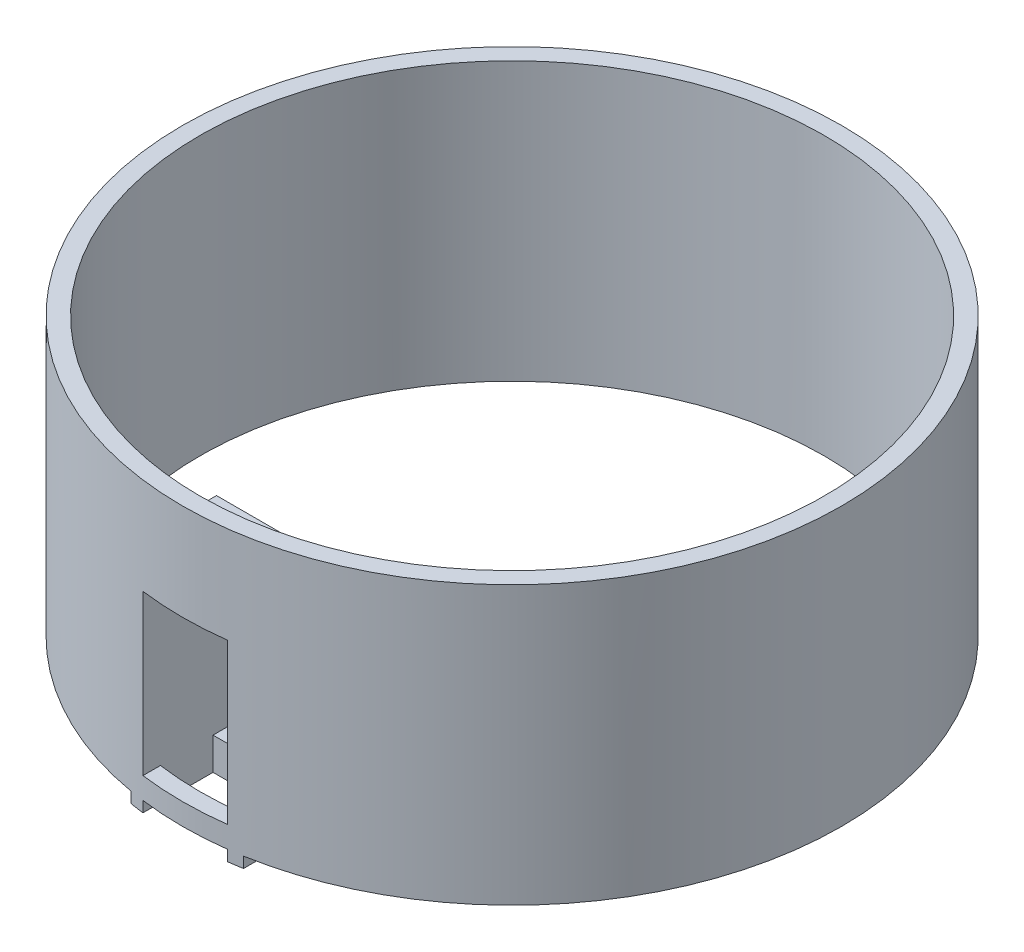
ISO-10303-21;
HEADER;
FILE_DESCRIPTION(('STEP AP214'),'2;1');
FILE_NAME('part.step','',(''),(''),'','','');
FILE_SCHEMA(('AUTOMOTIVE_DESIGN { 1 0 10303 214 1 1 1 1 }'));
ENDSEC;
DATA;
#1=APPLICATION_CONTEXT('core data for automotive mechanical design processes');
#2=APPLICATION_PROTOCOL_DEFINITION('international standard','automotive_design',2000,#1);
#3=PRODUCT_CONTEXT('',#1,'mechanical');
#4=PRODUCT('Part','Part','',(#3));
#5=PRODUCT_RELATED_PRODUCT_CATEGORY('part','',(#4));
#6=PRODUCT_DEFINITION_FORMATION('','',#4);
#7=PRODUCT_DEFINITION_CONTEXT('part definition',#1,'design');
#8=PRODUCT_DEFINITION('design','',#6,#7);
#9=PRODUCT_DEFINITION_SHAPE('','',#8);
#10=(LENGTH_UNIT() NAMED_UNIT(*) SI_UNIT(.MILLI.,.METRE.));
#11=(NAMED_UNIT(*) PLANE_ANGLE_UNIT() SI_UNIT($,.RADIAN.));
#12=(NAMED_UNIT(*) SI_UNIT($,.STERADIAN.) SOLID_ANGLE_UNIT());
#13=UNCERTAINTY_MEASURE_WITH_UNIT(LENGTH_MEASURE(1.E-05),#10,'distance_accuracy_value','');
#14=(GEOMETRIC_REPRESENTATION_CONTEXT(3) GLOBAL_UNCERTAINTY_ASSIGNED_CONTEXT((#13)) GLOBAL_UNIT_ASSIGNED_CONTEXT((#10,
#11,#12)) REPRESENTATION_CONTEXT('',''));
#15=CARTESIAN_POINT('',(0.,0.,0.));
#16=DIRECTION('',(0.,0.,1.));
#17=DIRECTION('',(1.,0.,0.));
#18=AXIS2_PLACEMENT_3D('',#15,#16,#17);
#19=CARTESIAN_POINT('',(0.,20.,0.));
#20=DIRECTION('',(0.,-1.,0.));
#21=DIRECTION('',(0.,0.,-1.));
#22=AXIS2_PLACEMENT_3D('',#19,#20,#21);
#23=CYLINDRICAL_SURFACE('',#22,45.);
#24=CARTESIAN_POINT('',(0.,20.,0.));
#25=DIRECTION('',(0.,1.,0.));
#26=DIRECTION('',(0.,0.,1.));
#27=AXIS2_PLACEMENT_3D('',#24,#25,#26);
#28=CIRCLE('',#27,45.);
#29=CARTESIAN_POINT('',(0.,20.,45.));
#30=VERTEX_POINT('',#29);
#31=EDGE_CURVE('E319',#30,#30,#28,.T.);
#32=ORIENTED_EDGE('',*,*,#31,.T.);
#33=EDGE_LOOP('',(#32));
#34=FACE_BOUND('',#33,.T.);
#35=DIRECTION('',(0.,-1.,0.));
#36=VECTOR('',#35,1.);
#37=CARTESIAN_POINT('',(6.10000000000001,20.,44.584638610176));
#38=LINE('',#37,#36);
#39=CARTESIAN_POINT('',(6.10000000000001,10.75,44.584638610176));
#40=VERTEX_POINT('',#39);
#41=CARTESIAN_POINT('',(6.10000000000001,6.1,44.584638610176));
#42=VERTEX_POINT('',#41);
#43=EDGE_CURVE('E281',#40,#42,#38,.T.);
#44=ORIENTED_EDGE('',*,*,#43,.T.);
#45=CARTESIAN_POINT('',(0.,6.1,0.));
#46=DIRECTION('',(0.,-1.,0.));
#47=DIRECTION('',(0.,0.,-1.));
#48=AXIS2_PLACEMENT_3D('',#45,#46,#47);
#49=CIRCLE('',#48,45.);
#50=CARTESIAN_POINT('',(-6.09999999999999,6.1,44.584638610176));
#51=VERTEX_POINT('',#50);
#52=EDGE_CURVE('E186',#42,#51,#49,.T.);
#53=ORIENTED_EDGE('',*,*,#52,.T.);
#54=DIRECTION('',(0.,-1.,0.));
#55=VECTOR('',#54,1.);
#56=CARTESIAN_POINT('',(-6.09999999999999,20.,44.584638610176));
#57=LINE('',#56,#55);
#58=CARTESIAN_POINT('',(-6.09999999999999,10.75,44.584638610176));
#59=VERTEX_POINT('',#58);
#60=EDGE_CURVE('E48',#51,#59,#57,.F.);
#61=ORIENTED_EDGE('',*,*,#60,.T.);
#62=CARTESIAN_POINT('',(0.,10.75,0.));
#63=DIRECTION('',(0.,-1.,0.));
#64=DIRECTION('',(1.,0.,0.));
#65=AXIS2_PLACEMENT_3D('',#62,#63,#64);
#66=CIRCLE('',#65,45.);
#67=CARTESIAN_POINT('',(-8.09999999999999,10.75,44.2649974584886));
#68=VERTEX_POINT('',#67);
#69=EDGE_CURVE('E329',#59,#68,#66,.T.);
#70=ORIENTED_EDGE('',*,*,#69,.T.);
#71=DIRECTION('',(0.,-1.,0.));
#72=VECTOR('',#71,1.);
#73=CARTESIAN_POINT('',(-8.09999999999999,20.,44.2649974584886));
#74=LINE('',#73,#72);
#75=CARTESIAN_POINT('',(-8.09999999999999,-20.,44.2649974584886));
#76=VERTEX_POINT('',#75);
#77=EDGE_CURVE('E334',#68,#76,#74,.T.);
#78=ORIENTED_EDGE('',*,*,#77,.T.);
#79=CARTESIAN_POINT('',(0.,-20.,0.));
#80=DIRECTION('',(0.,1.,0.));
#81=DIRECTION('',(0.,0.,1.));
#82=AXIS2_PLACEMENT_3D('',#79,#80,#81);
#83=CIRCLE('',#82,45.);
#84=CARTESIAN_POINT('',(8.1,-20.,44.2649974584886));
#85=VERTEX_POINT('',#84);
#86=EDGE_CURVE('E318',#85,#76,#83,.T.);
#87=ORIENTED_EDGE('',*,*,#86,.F.);
#88=DIRECTION('',(0.,-1.,0.));
#89=VECTOR('',#88,1.);
#90=CARTESIAN_POINT('',(8.1,20.,44.2649974584886));
#91=LINE('',#90,#89);
#92=CARTESIAN_POINT('',(8.1,10.75,44.2649974584886));
#93=VERTEX_POINT('',#92);
#94=EDGE_CURVE('E255',#85,#93,#91,.F.);
#95=ORIENTED_EDGE('',*,*,#94,.T.);
#96=CARTESIAN_POINT('',(0.,10.75,0.));
#97=DIRECTION('',(0.,-1.,0.));
#98=DIRECTION('',(1.,0.,0.));
#99=AXIS2_PLACEMENT_3D('',#96,#97,#98);
#100=CIRCLE('',#99,45.);
#101=EDGE_CURVE('E277',#93,#40,#100,.T.);
#102=ORIENTED_EDGE('',*,*,#101,.T.);
#103=EDGE_LOOP('',(#44,#53,#61,#70,#78,#87,#95,#102));
#104=FACE_BOUND('',#103,.T.);
#105=ADVANCED_FACE('F40',(#34,#104),#23,.F.);
#106=CARTESIAN_POINT('',(0.,20.,0.));
#107=DIRECTION('',(0.,-1.,0.));
#108=DIRECTION('',(0.,0.,-1.));
#109=AXIS2_PLACEMENT_3D('',#106,#107,#108);
#110=CYLINDRICAL_SURFACE('',#109,47.5);
#111=CARTESIAN_POINT('',(0.,20.,0.));
#112=DIRECTION('',(0.,1.,0.));
#113=DIRECTION('',(1.,0.,0.));
#114=AXIS2_PLACEMENT_3D('',#111,#112,#113);
#115=CIRCLE('',#114,47.5);
#116=CARTESIAN_POINT('',(47.5,20.,0.));
#117=VERTEX_POINT('',#116);
#118=EDGE_CURVE('E326',#117,#117,#115,.T.);
#119=ORIENTED_EDGE('',*,*,#118,.F.);
#120=EDGE_LOOP('',(#119));
#121=FACE_BOUND('',#120,.T.);
#122=CARTESIAN_POINT('',(0.,-20.,0.));
#123=DIRECTION('',(0.,1.,0.));
#124=DIRECTION('',(1.,0.,0.));
#125=AXIS2_PLACEMENT_3D('',#122,#123,#124);
#126=CIRCLE('',#125,47.5);
#127=CARTESIAN_POINT('',(-6.09999999999999,-20.,47.1066874233373));
#128=VERTEX_POINT('',#127);
#129=CARTESIAN_POINT('',(6.10000000000001,-20.,47.1066874233372));
#130=VERTEX_POINT('',#129);
#131=EDGE_CURVE('E330',#128,#130,#126,.T.);
#132=ORIENTED_EDGE('',*,*,#131,.T.);
#133=DIRECTION('',(0.,-1.,0.));
#134=VECTOR('',#133,1.);
#135=CARTESIAN_POINT('',(6.10000000000001,20.,47.1066874233372));
#136=LINE('',#135,#134);
#137=CARTESIAN_POINT('',(6.10000000000001,-21.55,47.1066874233372));
#138=VERTEX_POINT('',#137);
#139=EDGE_CURVE('E250',#138,#130,#136,.F.);
#140=ORIENTED_EDGE('',*,*,#139,.F.);
#141=CARTESIAN_POINT('',(0.,-21.55,0.));
#142=DIRECTION('',(0.,1.,0.));
#143=DIRECTION('',(-1.,0.,0.));
#144=AXIS2_PLACEMENT_3D('',#141,#142,#143);
#145=CIRCLE('',#144,47.5);
#146=CARTESIAN_POINT('',(8.1,-21.55,46.8042733091755));
#147=VERTEX_POINT('',#146);
#148=EDGE_CURVE('E253',#147,#138,#145,.F.);
#149=ORIENTED_EDGE('',*,*,#148,.F.);
#150=DIRECTION('',(0.,-1.,0.));
#151=VECTOR('',#150,1.);
#152=CARTESIAN_POINT('',(8.1,20.,46.8042733091755));
#153=LINE('',#152,#151);
#154=CARTESIAN_POINT('',(8.1,-20.,46.8042733091755));
#155=VERTEX_POINT('',#154);
#156=EDGE_CURVE('E252',#155,#147,#153,.T.);
#157=ORIENTED_EDGE('',*,*,#156,.F.);
#158=CARTESIAN_POINT('',(-8.09999999999999,-20.,46.8042733091755));
#159=VERTEX_POINT('',#158);
#160=EDGE_CURVE('E322',#155,#159,#126,.T.);
#161=ORIENTED_EDGE('',*,*,#160,.T.);
#162=DIRECTION('',(0.,-1.,0.));
#163=VECTOR('',#162,1.);
#164=CARTESIAN_POINT('',(-8.09999999999999,20.,46.8042733091755));
#165=LINE('',#164,#163);
#166=CARTESIAN_POINT('',(-8.09999999999999,-21.55,46.8042733091755));
#167=VERTEX_POINT('',#166);
#168=EDGE_CURVE('E290',#167,#159,#165,.F.);
#169=ORIENTED_EDGE('',*,*,#168,.F.);
#170=CARTESIAN_POINT('',(0.,-21.55,0.));
#171=DIRECTION('',(0.,1.,0.));
#172=DIRECTION('',(-1.,0.,0.));
#173=AXIS2_PLACEMENT_3D('',#170,#171,#172);
#174=CIRCLE('',#173,47.5);
#175=CARTESIAN_POINT('',(-6.09999999999999,-21.55,47.1066874233373));
#176=VERTEX_POINT('',#175);
#177=EDGE_CURVE('E287',#176,#167,#174,.F.);
#178=ORIENTED_EDGE('',*,*,#177,.F.);
#179=DIRECTION('',(0.,-1.,0.));
#180=VECTOR('',#179,1.);
#181=CARTESIAN_POINT('',(-6.09999999999999,20.,47.1066874233373));
#182=LINE('',#181,#180);
#183=EDGE_CURVE('E291',#128,#176,#182,.T.);
#184=ORIENTED_EDGE('',*,*,#183,.F.);
#185=EDGE_LOOP('',(#132,#140,#149,#157,#161,#169,#178,#184));
#186=FACE_BOUND('',#185,.T.);
#187=DIRECTION('',(0.,-1.,0.));
#188=VECTOR('',#187,1.);
#189=CARTESIAN_POINT('',(6.10000000000001,20.,47.1066874233372));
#190=LINE('',#189,#188);
#191=CARTESIAN_POINT('',(6.10000000000001,6.1,47.1066874233372));
#192=VERTEX_POINT('',#191);
#193=CARTESIAN_POINT('',(6.10000000000001,-16.9,47.1066874233372));
#194=VERTEX_POINT('',#193);
#195=EDGE_CURVE('E174',#192,#194,#190,.T.);
#196=ORIENTED_EDGE('',*,*,#195,.T.);
#197=CARTESIAN_POINT('',(0.,-16.9,0.));
#198=DIRECTION('',(0.,-1.,0.));
#199=DIRECTION('',(0.,0.,-1.));
#200=AXIS2_PLACEMENT_3D('',#197,#198,#199);
#201=CIRCLE('',#200,47.5);
#202=CARTESIAN_POINT('',(-6.09999999999999,-16.9,47.1066874233373));
#203=VERTEX_POINT('',#202);
#204=EDGE_CURVE('E192',#194,#203,#201,.T.);
#205=ORIENTED_EDGE('',*,*,#204,.T.);
#206=DIRECTION('',(0.,-1.,0.));
#207=VECTOR('',#206,1.);
#208=CARTESIAN_POINT('',(-6.09999999999999,20.,47.1066874233373));
#209=LINE('',#208,#207);
#210=CARTESIAN_POINT('',(-6.09999999999999,6.1,47.1066874233373));
#211=VERTEX_POINT('',#210);
#212=EDGE_CURVE('E178',#211,#203,#209,.T.);
#213=ORIENTED_EDGE('',*,*,#212,.F.);
#214=CARTESIAN_POINT('',(0.,6.1,0.));
#215=DIRECTION('',(0.,-1.,0.));
#216=DIRECTION('',(0.,0.,-1.));
#217=AXIS2_PLACEMENT_3D('',#214,#215,#216);
#218=CIRCLE('',#217,47.5);
#219=EDGE_CURVE('E183',#192,#211,#218,.T.);
#220=ORIENTED_EDGE('',*,*,#219,.F.);
#221=EDGE_LOOP('',(#196,#205,#213,#220));
#222=FACE_BOUND('',#221,.T.);
#223=ADVANCED_FACE('F42',(#121,#186,#222),#110,.T.);
#224=CARTESIAN_POINT('',(-6.09999999999999,10.75,47.501));
#225=DIRECTION('',(-1.,0.,0.));
#226=DIRECTION('',(0.,0.,1.));
#227=AXIS2_PLACEMENT_3D('',#224,#225,#226);
#228=PLANE('',#227);
#229=DIRECTION('',(0.,-1.,0.));
#230=VECTOR('',#229,1.);
#231=CARTESIAN_POINT('',(-6.09999999999999,-16.9,37.));
#232=LINE('',#231,#230);
#233=CARTESIAN_POINT('',(-6.09999999999999,-16.9,37.));
#234=VERTEX_POINT('',#233);
#235=CARTESIAN_POINT('',(-6.09999999999999,-21.55,37.));
#236=VERTEX_POINT('',#235);
#237=EDGE_CURVE('E232',#234,#236,#232,.T.);
#238=ORIENTED_EDGE('',*,*,#237,.F.);
#239=DIRECTION('',(0.,0.,-1.));
#240=VECTOR('',#239,1.);
#241=CARTESIAN_POINT('',(-6.09999999999999,-16.9,37.));
#242=LINE('',#241,#240);
#243=CARTESIAN_POINT('',(-6.09999999999999,-16.9,34.5));
#244=VERTEX_POINT('',#243);
#245=EDGE_CURVE('E242',#234,#244,#242,.T.);
#246=ORIENTED_EDGE('',*,*,#245,.T.);
#247=DIRECTION('',(0.,1.,0.));
#248=VECTOR('',#247,1.);
#249=CARTESIAN_POINT('',(-6.09999999999999,10.75,34.5));
#250=LINE('',#249,#248);
#251=CARTESIAN_POINT('',(-6.09999999999999,6.1,34.5));
#252=VERTEX_POINT('',#251);
#253=EDGE_CURVE('E302',#244,#252,#250,.T.);
#254=ORIENTED_EDGE('',*,*,#253,.T.);
#255=DIRECTION('',(0.,0.,-1.));
#256=VECTOR('',#255,1.);
#257=CARTESIAN_POINT('',(-6.09999999999999,6.1,37.));
#258=LINE('',#257,#256);
#259=CARTESIAN_POINT('',(-6.09999999999999,6.1,37.));
#260=VERTEX_POINT('',#259);
#261=EDGE_CURVE('E222',#260,#252,#258,.T.);
#262=ORIENTED_EDGE('',*,*,#261,.F.);
#263=DIRECTION('',(0.,-1.,0.));
#264=VECTOR('',#263,1.);
#265=CARTESIAN_POINT('',(-6.09999999999999,6.1,37.));
#266=LINE('',#265,#264);
#267=CARTESIAN_POINT('',(-6.09999999999999,10.75,37.));
#268=VERTEX_POINT('',#267);
#269=EDGE_CURVE('E209',#268,#260,#266,.T.);
#270=ORIENTED_EDGE('',*,*,#269,.F.);
#271=DIRECTION('',(0.,0.,-1.));
#272=VECTOR('',#271,1.);
#273=CARTESIAN_POINT('',(-6.09999999999999,10.75,47.501));
#274=LINE('',#273,#272);
#275=EDGE_CURVE('E304',#59,#268,#274,.T.);
#276=ORIENTED_EDGE('',*,*,#275,.F.);
#277=ORIENTED_EDGE('',*,*,#60,.F.);
#278=DIRECTION('',(0.,0.,-1.));
#279=VECTOR('',#278,1.);
#280=CARTESIAN_POINT('',(-6.09999999999999,6.1,47.5));
#281=LINE('',#280,#279);
#282=EDGE_CURVE('E179',#211,#51,#281,.T.);
#283=ORIENTED_EDGE('',*,*,#282,.F.);
#284=ORIENTED_EDGE('',*,*,#212,.T.);
#285=DIRECTION('',(0.,0.,-1.));
#286=VECTOR('',#285,1.);
#287=CARTESIAN_POINT('',(-6.09999999999999,-16.9,47.5));
#288=LINE('',#287,#286);
#289=CARTESIAN_POINT('',(-6.09999999999999,-16.9,44.584638610176));
#290=VERTEX_POINT('',#289);
#291=EDGE_CURVE('E392',#203,#290,#288,.T.);
#292=ORIENTED_EDGE('',*,*,#291,.T.);
#293=CARTESIAN_POINT('',(-6.09999999999999,-20.,44.584638610176));
#294=VERTEX_POINT('',#293);
#295=EDGE_CURVE('E12',#294,#290,#57,.F.);
#296=ORIENTED_EDGE('',*,*,#295,.F.);
#297=DIRECTION('',(0.,0.,1.));
#298=VECTOR('',#297,1.);
#299=CARTESIAN_POINT('',(-6.09999999999999,-20.,0.));
#300=LINE('',#299,#298);
#301=EDGE_CURVE('E316',#294,#128,#300,.T.);
#302=ORIENTED_EDGE('',*,*,#301,.T.);
#303=ORIENTED_EDGE('',*,*,#183,.T.);
#304=DIRECTION('',(0.,0.,-1.));
#305=VECTOR('',#304,1.);
#306=CARTESIAN_POINT('',(-6.09999999999999,-21.55,47.501));
#307=LINE('',#306,#305);
#308=EDGE_CURVE('E307',#176,#236,#307,.T.);
#309=ORIENTED_EDGE('',*,*,#308,.T.);
#310=EDGE_LOOP('',(#238,#246,#254,#262,#270,#276,#277,#283,#284,#292,#296,#302,#303,#309));
#311=FACE_BOUND('',#310,.T.);
#312=ADVANCED_FACE('F346',(#311),#228,.F.);
#313=CARTESIAN_POINT('',(6.10000000000001,10.75,47.501));
#314=DIRECTION('',(1.,0.,0.));
#315=DIRECTION('',(0.,0.,-1.));
#316=AXIS2_PLACEMENT_3D('',#313,#314,#315);
#317=PLANE('',#316);
#318=CARTESIAN_POINT('',(6.10000000000001,-16.9,44.584638610176));
#319=VERTEX_POINT('',#318);
#320=CARTESIAN_POINT('',(6.10000000000001,-20.,44.584638610176));
#321=VERTEX_POINT('',#320);
#322=EDGE_CURVE('E280',#319,#321,#38,.T.);
#323=ORIENTED_EDGE('',*,*,#322,.F.);
#324=DIRECTION('',(0.,0.,-1.));
#325=VECTOR('',#324,1.);
#326=CARTESIAN_POINT('',(6.10000000000001,-16.9,47.5));
#327=LINE('',#326,#325);
#328=EDGE_CURVE('E61',#194,#319,#327,.T.);
#329=ORIENTED_EDGE('',*,*,#328,.F.);
#330=ORIENTED_EDGE('',*,*,#195,.F.);
#331=DIRECTION('',(0.,0.,-1.));
#332=VECTOR('',#331,1.);
#333=CARTESIAN_POINT('',(6.10000000000001,6.1,47.5));
#334=LINE('',#333,#332);
#335=EDGE_CURVE('E55',#192,#42,#334,.T.);
#336=ORIENTED_EDGE('',*,*,#335,.T.);
#337=ORIENTED_EDGE('',*,*,#43,.F.);
#338=DIRECTION('',(0.,0.,-1.));
#339=VECTOR('',#338,1.);
#340=CARTESIAN_POINT('',(6.10000000000001,10.75,47.501));
#341=LINE('',#340,#339);
#342=CARTESIAN_POINT('',(6.10000000000001,10.75,37.));
#343=VERTEX_POINT('',#342);
#344=EDGE_CURVE('E266',#40,#343,#341,.T.);
#345=ORIENTED_EDGE('',*,*,#344,.T.);
#346=DIRECTION('',(0.,1.,0.));
#347=VECTOR('',#346,1.);
#348=CARTESIAN_POINT('',(6.10000000000001,10.75,37.));
#349=LINE('',#348,#347);
#350=CARTESIAN_POINT('',(6.10000000000001,6.1,37.));
#351=VERTEX_POINT('',#350);
#352=EDGE_CURVE('E215',#351,#343,#349,.T.);
#353=ORIENTED_EDGE('',*,*,#352,.F.);
#354=DIRECTION('',(0.,0.,-1.));
#355=VECTOR('',#354,1.);
#356=CARTESIAN_POINT('',(6.10000000000001,6.1,37.));
#357=LINE('',#356,#355);
#358=CARTESIAN_POINT('',(6.10000000000001,6.1,34.5));
#359=VERTEX_POINT('',#358);
#360=EDGE_CURVE('E218',#351,#359,#357,.T.);
#361=ORIENTED_EDGE('',*,*,#360,.T.);
#362=DIRECTION('',(0.,-1.,0.));
#363=VECTOR('',#362,1.);
#364=CARTESIAN_POINT('',(6.10000000000001,10.75,34.5));
#365=LINE('',#364,#363);
#366=CARTESIAN_POINT('',(6.10000000000001,-16.9,34.5));
#367=VERTEX_POINT('',#366);
#368=EDGE_CURVE('E258',#359,#367,#365,.T.);
#369=ORIENTED_EDGE('',*,*,#368,.T.);
#370=DIRECTION('',(0.,0.,-1.));
#371=VECTOR('',#370,1.);
#372=CARTESIAN_POINT('',(6.10000000000001,-16.9,37.));
#373=LINE('',#372,#371);
#374=CARTESIAN_POINT('',(6.10000000000001,-16.9,37.));
#375=VERTEX_POINT('',#374);
#376=EDGE_CURVE('E246',#375,#367,#373,.T.);
#377=ORIENTED_EDGE('',*,*,#376,.F.);
#378=DIRECTION('',(0.,1.,0.));
#379=VECTOR('',#378,1.);
#380=CARTESIAN_POINT('',(6.10000000000001,-21.55,37.));
#381=LINE('',#380,#379);
#382=CARTESIAN_POINT('',(6.10000000000001,-21.55,37.));
#383=VERTEX_POINT('',#382);
#384=EDGE_CURVE('E237',#383,#375,#381,.T.);
#385=ORIENTED_EDGE('',*,*,#384,.F.);
#386=DIRECTION('',(0.,0.,-1.));
#387=VECTOR('',#386,1.);
#388=CARTESIAN_POINT('',(6.10000000000001,-21.55,47.501));
#389=LINE('',#388,#387);
#390=EDGE_CURVE('E263',#138,#383,#389,.T.);
#391=ORIENTED_EDGE('',*,*,#390,.F.);
#392=ORIENTED_EDGE('',*,*,#139,.T.);
#393=DIRECTION('',(0.,0.,-1.));
#394=VECTOR('',#393,1.);
#395=CARTESIAN_POINT('',(6.10000000000001,-20.,0.));
#396=LINE('',#395,#394);
#397=EDGE_CURVE('E283',#130,#321,#396,.T.);
#398=ORIENTED_EDGE('',*,*,#397,.T.);
#399=EDGE_LOOP('',(#323,#329,#330,#336,#337,#345,#353,#361,#369,#377,#385,#391,#392,#398));
#400=FACE_BOUND('',#399,.T.);
#401=ADVANCED_FACE('F175',(#400),#317,.F.);
#402=CARTESIAN_POINT('',(0.,-20.,0.));
#403=DIRECTION('',(0.,1.,0.));
#404=DIRECTION('',(0.,0.,1.));
#405=AXIS2_PLACEMENT_3D('',#402,#403,#404);
#406=PLANE('',#405);
#407=ORIENTED_EDGE('',*,*,#397,.F.);
#408=ORIENTED_EDGE('',*,*,#131,.F.);
#409=ORIENTED_EDGE('',*,*,#301,.F.);
#410=EDGE_CURVE('E323',#294,#321,#83,.T.);
#411=ORIENTED_EDGE('',*,*,#410,.T.);
#412=EDGE_LOOP('',(#407,#408,#409,#411));
#413=FACE_BOUND('',#412,.T.);
#414=ADVANCED_FACE('F382',(#413),#406,.F.);
#415=DIRECTION('',(0.,0.,1.));
#416=VECTOR('',#415,1.);
#417=CARTESIAN_POINT('',(8.1,-20.,0.));
#418=LINE('',#417,#416);
#419=EDGE_CURVE('E275',#85,#155,#418,.T.);
#420=ORIENTED_EDGE('',*,*,#419,.F.);
#421=ORIENTED_EDGE('',*,*,#86,.T.);
#422=DIRECTION('',(0.,0.,-1.));
#423=VECTOR('',#422,1.);
#424=CARTESIAN_POINT('',(-8.09999999999999,-20.,0.));
#425=LINE('',#424,#423);
#426=EDGE_CURVE('E294',#159,#76,#425,.T.);
#427=ORIENTED_EDGE('',*,*,#426,.F.);
#428=ORIENTED_EDGE('',*,*,#160,.F.);
#429=EDGE_LOOP('',(#420,#421,#427,#428));
#430=FACE_BOUND('',#429,.T.);
#431=ADVANCED_FACE('F439',(#430),#406,.F.);
#432=CARTESIAN_POINT('',(0.,-16.9,0.));
#433=DIRECTION('',(0.,-1.,0.));
#434=DIRECTION('',(0.,0.,-1.));
#435=AXIS2_PLACEMENT_3D('',#432,#433,#434);
#436=CIRCLE('',#435,45.);
#437=EDGE_CURVE('E197',#319,#290,#436,.T.);
#438=ORIENTED_EDGE('',*,*,#437,.F.);
#439=ORIENTED_EDGE('',*,*,#322,.T.);
#440=ORIENTED_EDGE('',*,*,#410,.F.);
#441=ORIENTED_EDGE('',*,*,#295,.T.);
#442=EDGE_LOOP('',(#438,#439,#440,#441));
#443=FACE_BOUND('',#442,.T.);
#444=ADVANCED_FACE('F387',(#443),#23,.F.);
#445=CARTESIAN_POINT('',(0.,20.,0.));
#446=DIRECTION('',(0.,1.,0.));
#447=DIRECTION('',(0.,0.,1.));
#448=AXIS2_PLACEMENT_3D('',#445,#446,#447);
#449=PLANE('',#448);
#450=ORIENTED_EDGE('',*,*,#118,.T.);
#451=EDGE_LOOP('',(#450));
#452=FACE_BOUND('',#451,.T.);
#453=ORIENTED_EDGE('',*,*,#31,.F.);
#454=EDGE_LOOP('',(#453));
#455=FACE_BOUND('',#454,.T.);
#456=ADVANCED_FACE('F438',(#452,#455),#449,.T.);
#457=CARTESIAN_POINT('',(-8.09999999999999,-21.55,47.501));
#458=DIRECTION('',(1.,0.,0.));
#459=DIRECTION('',(0.,0.,-1.));
#460=AXIS2_PLACEMENT_3D('',#457,#458,#459);
#461=PLANE('',#460);
#462=ORIENTED_EDGE('',*,*,#168,.T.);
#463=ORIENTED_EDGE('',*,*,#426,.T.);
#464=ORIENTED_EDGE('',*,*,#77,.F.);
#465=DIRECTION('',(0.,0.,-1.));
#466=VECTOR('',#465,1.);
#467=CARTESIAN_POINT('',(-8.09999999999999,10.75,47.501));
#468=LINE('',#467,#466);
#469=CARTESIAN_POINT('',(-8.09999999999999,10.75,34.5));
#470=VERTEX_POINT('',#469);
#471=EDGE_CURVE('E311',#68,#470,#468,.T.);
#472=ORIENTED_EDGE('',*,*,#471,.T.);
#473=DIRECTION('',(0.,-1.,0.));
#474=VECTOR('',#473,1.);
#475=CARTESIAN_POINT('',(-8.09999999999999,-21.55,34.5));
#476=LINE('',#475,#474);
#477=CARTESIAN_POINT('',(-8.09999999999999,-21.55,34.5));
#478=VERTEX_POINT('',#477);
#479=EDGE_CURVE('E297',#470,#478,#476,.T.);
#480=ORIENTED_EDGE('',*,*,#479,.T.);
#481=DIRECTION('',(0.,0.,-1.));
#482=VECTOR('',#481,1.);
#483=CARTESIAN_POINT('',(-8.09999999999999,-21.55,47.501));
#484=LINE('',#483,#482);
#485=EDGE_CURVE('E309',#167,#478,#484,.T.);
#486=ORIENTED_EDGE('',*,*,#485,.F.);
#487=EDGE_LOOP('',(#462,#463,#464,#472,#480,#486));
#488=FACE_BOUND('',#487,.T.);
#489=ADVANCED_FACE('F444',(#488),#461,.F.);
#490=CARTESIAN_POINT('',(-8.09999999999999,10.75,47.501));
#491=DIRECTION('',(0.,-1.,0.));
#492=DIRECTION('',(1.,0.,0.));
#493=AXIS2_PLACEMENT_3D('',#490,#491,#492);
#494=PLANE('',#493);
#495=ORIENTED_EDGE('',*,*,#69,.F.);
#496=ORIENTED_EDGE('',*,*,#275,.T.);
#497=DIRECTION('',(-1.,0.,0.));
#498=VECTOR('',#497,1.);
#499=CARTESIAN_POINT('',(-6.09999999999999,10.75,37.));
#500=LINE('',#499,#498);
#501=EDGE_CURVE('E206',#343,#268,#500,.T.);
#502=ORIENTED_EDGE('',*,*,#501,.F.);
#503=ORIENTED_EDGE('',*,*,#344,.F.);
#504=ORIENTED_EDGE('',*,*,#101,.F.);
#505=DIRECTION('',(0.,0.,-1.));
#506=VECTOR('',#505,1.);
#507=CARTESIAN_POINT('',(8.1,10.75,47.501));
#508=LINE('',#507,#506);
#509=CARTESIAN_POINT('',(8.1,10.75,34.5));
#510=VERTEX_POINT('',#509);
#511=EDGE_CURVE('E268',#93,#510,#508,.T.);
#512=ORIENTED_EDGE('',*,*,#511,.T.);
#513=DIRECTION('',(-1.,0.,0.));
#514=VECTOR('',#513,1.);
#515=CARTESIAN_POINT('',(-8.09999999999999,10.75,34.5));
#516=LINE('',#515,#514);
#517=EDGE_CURVE('E286',#510,#470,#516,.T.);
#518=ORIENTED_EDGE('',*,*,#517,.T.);
#519=ORIENTED_EDGE('',*,*,#471,.F.);
#520=EDGE_LOOP('',(#495,#496,#502,#503,#504,#512,#518,#519));
#521=FACE_BOUND('',#520,.T.);
#522=ADVANCED_FACE('F344',(#521),#494,.F.);
#523=CARTESIAN_POINT('',(0.,0.,34.5));
#524=DIRECTION('',(0.,0.,-1.));
#525=DIRECTION('',(-1.,0.,0.));
#526=AXIS2_PLACEMENT_3D('',#523,#524,#525);
#527=PLANE('',#526);
#528=DIRECTION('',(1.,0.,0.));
#529=VECTOR('',#528,1.);
#530=CARTESIAN_POINT('',(6.10000000000001,6.1,34.5));
#531=LINE('',#530,#529);
#532=EDGE_CURVE('E203',#252,#359,#531,.T.);
#533=ORIENTED_EDGE('',*,*,#532,.F.);
#534=ORIENTED_EDGE('',*,*,#253,.F.);
#535=DIRECTION('',(-1.,0.,0.));
#536=VECTOR('',#535,1.);
#537=CARTESIAN_POINT('',(6.10000000000001,-16.9,34.5));
#538=LINE('',#537,#536);
#539=EDGE_CURVE('E229',#367,#244,#538,.T.);
#540=ORIENTED_EDGE('',*,*,#539,.F.);
#541=ORIENTED_EDGE('',*,*,#368,.F.);
#542=EDGE_LOOP('',(#533,#534,#540,#541));
#543=FACE_BOUND('',#542,.T.);
#544=ORIENTED_EDGE('',*,*,#517,.F.);
#545=DIRECTION('',(0.,1.,0.));
#546=VECTOR('',#545,1.);
#547=CARTESIAN_POINT('',(8.1,-21.55,34.5));
#548=LINE('',#547,#546);
#549=CARTESIAN_POINT('',(8.1,-21.55,34.5));
#550=VERTEX_POINT('',#549);
#551=EDGE_CURVE('E249',#550,#510,#548,.T.);
#552=ORIENTED_EDGE('',*,*,#551,.F.);
#553=DIRECTION('',(1.,0.,0.));
#554=VECTOR('',#553,1.);
#555=CARTESIAN_POINT('',(-8.09999999999999,-21.55,34.5));
#556=LINE('',#555,#554);
#557=EDGE_CURVE('E300',#478,#550,#556,.T.);
#558=ORIENTED_EDGE('',*,*,#557,.F.);
#559=ORIENTED_EDGE('',*,*,#479,.F.);
#560=EDGE_LOOP('',(#544,#552,#558,#559));
#561=FACE_BOUND('',#560,.T.);
#562=CARTESIAN_POINT('',(0.,-19.55,34.5));
#563=DIRECTION('',(0.,0.,1.));
#564=DIRECTION('',(1.,0.,0.));
#565=AXIS2_PLACEMENT_3D('',#562,#563,#564);
#566=CIRCLE('',#565,1.1);
#567=CARTESIAN_POINT('',(1.1,-19.55,34.5));
#568=VERTEX_POINT('',#567);
#569=EDGE_CURVE('E225',#568,#568,#566,.T.);
#570=ORIENTED_EDGE('',*,*,#569,.T.);
#571=EDGE_LOOP('',(#570));
#572=FACE_BOUND('',#571,.T.);
#573=CARTESIAN_POINT('',(0.,8.75,34.5));
#574=DIRECTION('',(0.,0.,1.));
#575=DIRECTION('',(-1.,0.,0.));
#576=AXIS2_PLACEMENT_3D('',#573,#574,#575);
#577=CIRCLE('',#576,1.1);
#578=CARTESIAN_POINT('',(-1.1,8.75,34.5));
#579=VERTEX_POINT('',#578);
#580=EDGE_CURVE('E199',#579,#579,#577,.T.);
#581=ORIENTED_EDGE('',*,*,#580,.T.);
#582=EDGE_LOOP('',(#581));
#583=FACE_BOUND('',#582,.T.);
#584=ADVANCED_FACE('F359',(#543,#561,#572,#583),#527,.T.);
#585=CARTESIAN_POINT('',(-8.09999999999999,-21.55,47.501));
#586=DIRECTION('',(0.,1.,0.));
#587=DIRECTION('',(-1.,0.,0.));
#588=AXIS2_PLACEMENT_3D('',#585,#586,#587);
#589=PLANE('',#588);
#590=ORIENTED_EDGE('',*,*,#308,.F.);
#591=ORIENTED_EDGE('',*,*,#177,.T.);
#592=ORIENTED_EDGE('',*,*,#485,.T.);
#593=ORIENTED_EDGE('',*,*,#557,.T.);
#594=DIRECTION('',(0.,0.,-1.));
#595=VECTOR('',#594,1.);
#596=CARTESIAN_POINT('',(8.1,-21.55,47.501));
#597=LINE('',#596,#595);
#598=EDGE_CURVE('E260',#147,#550,#597,.T.);
#599=ORIENTED_EDGE('',*,*,#598,.F.);
#600=ORIENTED_EDGE('',*,*,#148,.T.);
#601=ORIENTED_EDGE('',*,*,#390,.T.);
#602=DIRECTION('',(1.,0.,0.));
#603=VECTOR('',#602,1.);
#604=CARTESIAN_POINT('',(-6.09999999999999,-21.55,37.));
#605=LINE('',#604,#603);
#606=EDGE_CURVE('E235',#236,#383,#605,.T.);
#607=ORIENTED_EDGE('',*,*,#606,.F.);
#608=EDGE_LOOP('',(#590,#591,#592,#593,#599,#600,#601,#607));
#609=FACE_BOUND('',#608,.T.);
#610=ADVANCED_FACE('F372',(#609),#589,.F.);
#611=CARTESIAN_POINT('',(8.1,-21.55,47.501));
#612=DIRECTION('',(-1.,0.,0.));
#613=DIRECTION('',(0.,0.,1.));
#614=AXIS2_PLACEMENT_3D('',#611,#612,#613);
#615=PLANE('',#614);
#616=ORIENTED_EDGE('',*,*,#94,.F.);
#617=ORIENTED_EDGE('',*,*,#419,.T.);
#618=ORIENTED_EDGE('',*,*,#156,.T.);
#619=ORIENTED_EDGE('',*,*,#598,.T.);
#620=ORIENTED_EDGE('',*,*,#551,.T.);
#621=ORIENTED_EDGE('',*,*,#511,.F.);
#622=EDGE_LOOP('',(#616,#617,#618,#619,#620,#621));
#623=FACE_BOUND('',#622,.T.);
#624=ADVANCED_FACE('F401',(#623),#615,.F.);
#625=CARTESIAN_POINT('',(0.,0.,37.));
#626=DIRECTION('',(0.,0.,1.));
#627=DIRECTION('',(1.,0.,0.));
#628=AXIS2_PLACEMENT_3D('',#625,#626,#627);
#629=PLANE('',#628);
#630=ORIENTED_EDGE('',*,*,#237,.T.);
#631=ORIENTED_EDGE('',*,*,#606,.T.);
#632=ORIENTED_EDGE('',*,*,#384,.T.);
#633=DIRECTION('',(-1.,0.,0.));
#634=VECTOR('',#633,1.);
#635=CARTESIAN_POINT('',(6.10000000000001,-16.9,37.));
#636=LINE('',#635,#634);
#637=EDGE_CURVE('E239',#375,#234,#636,.T.);
#638=ORIENTED_EDGE('',*,*,#637,.T.);
#639=EDGE_LOOP('',(#630,#631,#632,#638));
#640=FACE_BOUND('',#639,.T.);
#641=CARTESIAN_POINT('',(0.,-19.55,37.));
#642=DIRECTION('',(0.,0.,1.));
#643=DIRECTION('',(1.,0.,0.));
#644=AXIS2_PLACEMENT_3D('',#641,#642,#643);
#645=CIRCLE('',#644,1.1);
#646=CARTESIAN_POINT('',(1.1,-19.55,37.));
#647=VERTEX_POINT('',#646);
#648=EDGE_CURVE('E226',#647,#647,#645,.T.);
#649=ORIENTED_EDGE('',*,*,#648,.F.);
#650=EDGE_LOOP('',(#649));
#651=FACE_BOUND('',#650,.T.);
#652=ADVANCED_FACE('F398',(#640,#651),#629,.T.);
#653=CARTESIAN_POINT('',(6.10000000000001,-16.9,37.));
#654=DIRECTION('',(0.,-1.,0.));
#655=DIRECTION('',(0.,0.,-1.));
#656=AXIS2_PLACEMENT_3D('',#653,#654,#655);
#657=PLANE('',#656);
#658=ORIENTED_EDGE('',*,*,#539,.T.);
#659=ORIENTED_EDGE('',*,*,#245,.F.);
#660=ORIENTED_EDGE('',*,*,#637,.F.);
#661=ORIENTED_EDGE('',*,*,#376,.T.);
#662=EDGE_LOOP('',(#658,#659,#660,#661));
#663=FACE_BOUND('',#662,.T.);
#664=ADVANCED_FACE('F364',(#663),#657,.F.);
#665=CARTESIAN_POINT('',(0.,-19.55,37.));
#666=DIRECTION('',(0.,0.,-1.));
#667=DIRECTION('',(-1.,0.,0.));
#668=AXIS2_PLACEMENT_3D('',#665,#666,#667);
#669=CYLINDRICAL_SURFACE('',#668,1.1);
#670=ORIENTED_EDGE('',*,*,#648,.T.);
#671=EDGE_LOOP('',(#670));
#672=FACE_BOUND('',#671,.T.);
#673=ORIENTED_EDGE('',*,*,#569,.F.);
#674=EDGE_LOOP('',(#673));
#675=FACE_BOUND('',#674,.T.);
#676=ADVANCED_FACE('F405',(#672,#675),#669,.F.);
#677=CARTESIAN_POINT('',(0.,0.,37.));
#678=DIRECTION('',(0.,0.,-1.));
#679=DIRECTION('',(-1.,0.,0.));
#680=AXIS2_PLACEMENT_3D('',#677,#678,#679);
#681=PLANE('',#680);
#682=ORIENTED_EDGE('',*,*,#501,.T.);
#683=ORIENTED_EDGE('',*,*,#269,.T.);
#684=DIRECTION('',(1.,0.,0.));
#685=VECTOR('',#684,1.);
#686=CARTESIAN_POINT('',(6.10000000000001,6.1,37.));
#687=LINE('',#686,#685);
#688=EDGE_CURVE('E212',#260,#351,#687,.T.);
#689=ORIENTED_EDGE('',*,*,#688,.T.);
#690=ORIENTED_EDGE('',*,*,#352,.T.);
#691=EDGE_LOOP('',(#682,#683,#689,#690));
#692=FACE_BOUND('',#691,.T.);
#693=CARTESIAN_POINT('',(0.,8.75,37.));
#694=DIRECTION('',(0.,0.,1.));
#695=DIRECTION('',(-1.,0.,0.));
#696=AXIS2_PLACEMENT_3D('',#693,#694,#695);
#697=CIRCLE('',#696,1.1);
#698=CARTESIAN_POINT('',(-1.1,8.75,37.));
#699=VERTEX_POINT('',#698);
#700=EDGE_CURVE('E200',#699,#699,#697,.T.);
#701=ORIENTED_EDGE('',*,*,#700,.F.);
#702=EDGE_LOOP('',(#701));
#703=FACE_BOUND('',#702,.T.);
#704=ADVANCED_FACE('F349',(#692,#703),#681,.F.);
#705=CARTESIAN_POINT('',(6.10000000000001,6.1,37.));
#706=DIRECTION('',(0.,1.,0.));
#707=DIRECTION('',(0.,0.,1.));
#708=AXIS2_PLACEMENT_3D('',#705,#706,#707);
#709=PLANE('',#708);
#710=ORIENTED_EDGE('',*,*,#532,.T.);
#711=ORIENTED_EDGE('',*,*,#360,.F.);
#712=ORIENTED_EDGE('',*,*,#688,.F.);
#713=ORIENTED_EDGE('',*,*,#261,.T.);
#714=EDGE_LOOP('',(#710,#711,#712,#713));
#715=FACE_BOUND('',#714,.T.);
#716=ADVANCED_FACE('F353',(#715),#709,.F.);
#717=CARTESIAN_POINT('',(0.,8.75,37.));
#718=DIRECTION('',(0.,0.,-1.));
#719=DIRECTION('',(-1.,0.,0.));
#720=AXIS2_PLACEMENT_3D('',#717,#718,#719);
#721=CYLINDRICAL_SURFACE('',#720,1.1);
#722=ORIENTED_EDGE('',*,*,#700,.T.);
#723=EDGE_LOOP('',(#722));
#724=FACE_BOUND('',#723,.T.);
#725=ORIENTED_EDGE('',*,*,#580,.F.);
#726=EDGE_LOOP('',(#725));
#727=FACE_BOUND('',#726,.T.);
#728=ADVANCED_FACE('F416',(#724,#727),#721,.F.);
#729=CARTESIAN_POINT('',(6.10000000000001,-16.9,47.5));
#730=DIRECTION('',(0.,-1.,0.));
#731=DIRECTION('',(0.,0.,-1.));
#732=AXIS2_PLACEMENT_3D('',#729,#730,#731);
#733=PLANE('',#732);
#734=ORIENTED_EDGE('',*,*,#437,.T.);
#735=ORIENTED_EDGE('',*,*,#291,.F.);
#736=ORIENTED_EDGE('',*,*,#204,.F.);
#737=ORIENTED_EDGE('',*,*,#328,.T.);
#738=EDGE_LOOP('',(#734,#735,#736,#737));
#739=FACE_BOUND('',#738,.T.);
#740=ADVANCED_FACE('F391',(#739),#733,.F.);
#741=CARTESIAN_POINT('',(6.10000000000001,6.1,47.5));
#742=DIRECTION('',(0.,-1.,0.));
#743=DIRECTION('',(0.,0.,-1.));
#744=AXIS2_PLACEMENT_3D('',#741,#742,#743);
#745=PLANE('',#744);
#746=ORIENTED_EDGE('',*,*,#335,.F.);
#747=ORIENTED_EDGE('',*,*,#219,.T.);
#748=ORIENTED_EDGE('',*,*,#282,.T.);
#749=ORIENTED_EDGE('',*,*,#52,.F.);
#750=EDGE_LOOP('',(#746,#747,#748,#749));
#751=FACE_BOUND('',#750,.T.);
#752=ADVANCED_FACE('F182',(#751),#745,.T.);
#753=CLOSED_SHELL('',(#105,#223,#312,#401,#414,#431,#444,#456,#489,#522,#584,#610,#624,#652,
#664,#676,#704,#716,#728,#740,#752));
#754=MANIFOLD_SOLID_BREP('B2',#753);
#755=ADVANCED_BREP_SHAPE_REPRESENTATION('',(#18,#754),#14);
#756=SHAPE_DEFINITION_REPRESENTATION(#9,#755);
ENDSEC;
END-ISO-10303-21;
